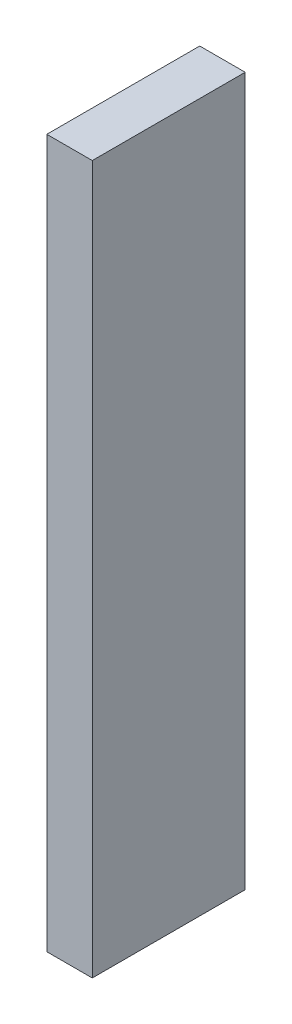
ISO-10303-21;
HEADER;
FILE_DESCRIPTION(('STEP AP214'),'2;1');
FILE_NAME('part.step','',(''),(''),'','','');
FILE_SCHEMA(('AUTOMOTIVE_DESIGN { 1 0 10303 214 1 1 1 1 }'));
ENDSEC;
DATA;
#1=APPLICATION_CONTEXT('core data for automotive mechanical design processes');
#2=APPLICATION_PROTOCOL_DEFINITION('international standard','automotive_design',2000,#1);
#3=PRODUCT_CONTEXT('',#1,'mechanical');
#4=PRODUCT('Part','Part','',(#3));
#5=PRODUCT_RELATED_PRODUCT_CATEGORY('part','',(#4));
#6=PRODUCT_DEFINITION_FORMATION('','',#4);
#7=PRODUCT_DEFINITION_CONTEXT('part definition',#1,'design');
#8=PRODUCT_DEFINITION('design','',#6,#7);
#9=PRODUCT_DEFINITION_SHAPE('','',#8);
#10=(LENGTH_UNIT() NAMED_UNIT(*) SI_UNIT(.MILLI.,.METRE.));
#11=(NAMED_UNIT(*) PLANE_ANGLE_UNIT() SI_UNIT($,.RADIAN.));
#12=(NAMED_UNIT(*) SI_UNIT($,.STERADIAN.) SOLID_ANGLE_UNIT());
#13=UNCERTAINTY_MEASURE_WITH_UNIT(LENGTH_MEASURE(1.E-05),#10,'distance_accuracy_value','');
#14=(GEOMETRIC_REPRESENTATION_CONTEXT(3) GLOBAL_UNCERTAINTY_ASSIGNED_CONTEXT((#13)) GLOBAL_UNIT_ASSIGNED_CONTEXT((#10,
#11,#12)) REPRESENTATION_CONTEXT('',''));
#15=CARTESIAN_POINT('',(0.,0.,0.));
#16=DIRECTION('',(0.,0.,1.));
#17=DIRECTION('',(1.,0.,0.));
#18=AXIS2_PLACEMENT_3D('',#15,#16,#17);
#19=CARTESIAN_POINT('',(130.275545220941,22.4180708263693,81.0720244776067));
#20=DIRECTION('',(-1.69244514382854E-09,0.,1.));
#21=DIRECTION('',(1.,0.,1.69244514382854E-09));
#22=AXIS2_PLACEMENT_3D('',#19,#20,#21);
#23=PLANE('',#22);
#24=DIRECTION('',(0.,-1.,0.));
#25=VECTOR('',#24,1.);
#26=CARTESIAN_POINT('',(131.258630317954,22.4180708263693,81.0720244792705));
#27=LINE('',#26,#25);
#28=CARTESIAN_POINT('',(131.258630317954,22.4180708263693,81.0720244792705));
#29=VERTEX_POINT('',#28);
#30=CARTESIAN_POINT('',(131.258630317954,7.11212965552236,81.0720244792705));
#31=VERTEX_POINT('',#30);
#32=EDGE_CURVE('E79',#29,#31,#27,.T.);
#33=ORIENTED_EDGE('',*,*,#32,.F.);
#34=DIRECTION('',(1.,0.,1.69244514382854E-09));
#35=VECTOR('',#34,1.);
#36=CARTESIAN_POINT('',(130.275545220941,22.4180708263693,81.0720244776067));
#37=LINE('',#36,#35);
#38=CARTESIAN_POINT('',(130.275545220941,22.4180708263693,81.0720244776067));
#39=VERTEX_POINT('',#38);
#40=EDGE_CURVE('E32',#39,#29,#37,.T.);
#41=ORIENTED_EDGE('',*,*,#40,.F.);
#42=DIRECTION('',(0.,-1.,0.));
#43=VECTOR('',#42,1.);
#44=CARTESIAN_POINT('',(130.275545220941,22.4180708263693,81.0720244776067));
#45=LINE('',#44,#43);
#46=CARTESIAN_POINT('',(130.275545220941,7.11212965552236,81.0720244776067));
#47=VERTEX_POINT('',#46);
#48=EDGE_CURVE('E71',#39,#47,#45,.T.);
#49=ORIENTED_EDGE('',*,*,#48,.T.);
#50=DIRECTION('',(1.,0.,1.69244514382854E-09));
#51=VECTOR('',#50,1.);
#52=CARTESIAN_POINT('',(130.275545220941,7.11212965552236,81.0720244776067));
#53=LINE('',#52,#51);
#54=EDGE_CURVE('E10',#47,#31,#53,.T.);
#55=ORIENTED_EDGE('',*,*,#54,.T.);
#56=EDGE_LOOP('',(#33,#41,#49,#55));
#57=FACE_BOUND('',#56,.T.);
#58=ADVANCED_FACE('F16',(#57),#23,.T.);
#59=CARTESIAN_POINT('',(130.275545220941,7.11212965552236,81.0720244776067));
#60=DIRECTION('',(0.,-1.,0.));
#61=DIRECTION('',(0.,0.,-1.));
#62=AXIS2_PLACEMENT_3D('',#59,#60,#61);
#63=PLANE('',#62);
#64=DIRECTION('',(1.69244514382854E-09,0.,-1.));
#65=VECTOR('',#64,1.);
#66=CARTESIAN_POINT('',(131.258630317954,7.11212965552236,81.0720244792705));
#67=LINE('',#66,#65);
#68=CARTESIAN_POINT('',(131.258630323549,7.11212965552235,77.7660833084218));
#69=VERTEX_POINT('',#68);
#70=EDGE_CURVE('E82',#31,#69,#67,.T.);
#71=ORIENTED_EDGE('',*,*,#70,.F.);
#72=ORIENTED_EDGE('',*,*,#54,.F.);
#73=DIRECTION('',(1.69244514382854E-09,0.,-1.));
#74=VECTOR('',#73,1.);
#75=CARTESIAN_POINT('',(130.275545220941,7.11212965552236,81.0720244776067));
#76=LINE('',#75,#74);
#77=CARTESIAN_POINT('',(130.275545226536,7.11212965552235,77.7660833067579));
#78=VERTEX_POINT('',#77);
#79=EDGE_CURVE('E67',#47,#78,#76,.T.);
#80=ORIENTED_EDGE('',*,*,#79,.T.);
#81=DIRECTION('',(1.,0.,1.69244514382854E-09));
#82=VECTOR('',#81,1.);
#83=CARTESIAN_POINT('',(130.275545226536,7.11212965552235,77.7660833067579));
#84=LINE('',#83,#82);
#85=EDGE_CURVE('E24',#78,#69,#84,.T.);
#86=ORIENTED_EDGE('',*,*,#85,.T.);
#87=EDGE_LOOP('',(#71,#72,#80,#86));
#88=FACE_BOUND('',#87,.T.);
#89=ADVANCED_FACE('F68',(#88),#63,.T.);
#90=CARTESIAN_POINT('',(130.275545226536,7.11212965552235,77.7660833067579));
#91=DIRECTION('',(1.69244514382854E-09,0.,-1.));
#92=DIRECTION('',(-1.,0.,-1.69244514382854E-09));
#93=AXIS2_PLACEMENT_3D('',#90,#91,#92);
#94=PLANE('',#93);
#95=DIRECTION('',(0.,1.,0.));
#96=VECTOR('',#95,1.);
#97=CARTESIAN_POINT('',(131.258630323549,7.11212965552235,77.7660833084218));
#98=LINE('',#97,#96);
#99=CARTESIAN_POINT('',(131.258630323549,22.418070826371,77.7660832999612));
#100=VERTEX_POINT('',#99);
#101=EDGE_CURVE('E65',#69,#100,#98,.T.);
#102=ORIENTED_EDGE('',*,*,#101,.F.);
#103=ORIENTED_EDGE('',*,*,#85,.F.);
#104=DIRECTION('',(0.,1.,0.));
#105=VECTOR('',#104,1.);
#106=CARTESIAN_POINT('',(130.275545226536,7.11212965552235,77.7660833067579));
#107=LINE('',#106,#105);
#108=CARTESIAN_POINT('',(130.275545226536,22.418070826371,77.7660832982974));
#109=VERTEX_POINT('',#108);
#110=EDGE_CURVE('E62',#78,#109,#107,.T.);
#111=ORIENTED_EDGE('',*,*,#110,.T.);
#112=DIRECTION('',(1.,0.,1.69244514382854E-09));
#113=VECTOR('',#112,1.);
#114=CARTESIAN_POINT('',(130.275545226536,22.418070826371,77.7660832982974));
#115=LINE('',#114,#113);
#116=EDGE_CURVE('E48',#109,#100,#115,.T.);
#117=ORIENTED_EDGE('',*,*,#116,.T.);
#118=EDGE_LOOP('',(#102,#103,#111,#117));
#119=FACE_BOUND('',#118,.T.);
#120=ADVANCED_FACE('F60',(#119),#94,.T.);
#121=CARTESIAN_POINT('',(130.275545226536,22.418070826371,77.7660832982974));
#122=DIRECTION('',(0.,1.,0.));
#123=DIRECTION('',(-1.,0.,0.));
#124=AXIS2_PLACEMENT_3D('',#121,#122,#123);
#125=PLANE('',#124);
#126=DIRECTION('',(-1.69244514382854E-09,0.,1.));
#127=VECTOR('',#126,1.);
#128=CARTESIAN_POINT('',(131.258630323549,22.418070826371,77.7660832999612));
#129=LINE('',#128,#127);
#130=EDGE_CURVE('E85',#100,#29,#129,.T.);
#131=ORIENTED_EDGE('',*,*,#130,.F.);
#132=ORIENTED_EDGE('',*,*,#116,.F.);
#133=DIRECTION('',(-1.69244514382854E-09,0.,1.));
#134=VECTOR('',#133,1.);
#135=CARTESIAN_POINT('',(130.275545226536,22.418070826371,77.7660832982974));
#136=LINE('',#135,#134);
#137=EDGE_CURVE('E74',#109,#39,#136,.T.);
#138=ORIENTED_EDGE('',*,*,#137,.T.);
#139=ORIENTED_EDGE('',*,*,#40,.T.);
#140=EDGE_LOOP('',(#131,#132,#138,#139));
#141=FACE_BOUND('',#140,.T.);
#142=ADVANCED_FACE('F96',(#141),#125,.T.);
#143=CARTESIAN_POINT('',(130.275545201028,17.2651002409467,92.8378607087388));
#144=DIRECTION('',(1.,0.,1.69244514382854E-09));
#145=DIRECTION('',(0.,1.,0.));
#146=AXIS2_PLACEMENT_3D('',#143,#144,#145);
#147=PLANE('',#146);
#148=ORIENTED_EDGE('',*,*,#48,.F.);
#149=ORIENTED_EDGE('',*,*,#137,.F.);
#150=ORIENTED_EDGE('',*,*,#110,.F.);
#151=ORIENTED_EDGE('',*,*,#79,.F.);
#152=EDGE_LOOP('',(#148,#149,#150,#151));
#153=FACE_BOUND('',#152,.T.);
#154=ADVANCED_FACE('F73',(#153),#147,.F.);
#155=CARTESIAN_POINT('',(131.258630298041,17.2651002409467,92.8378607104026));
#156=DIRECTION('',(1.,0.,1.69244514382854E-09));
#157=DIRECTION('',(0.,1.,0.));
#158=AXIS2_PLACEMENT_3D('',#155,#156,#157);
#159=PLANE('',#158);
#160=ORIENTED_EDGE('',*,*,#32,.T.);
#161=ORIENTED_EDGE('',*,*,#70,.T.);
#162=ORIENTED_EDGE('',*,*,#101,.T.);
#163=ORIENTED_EDGE('',*,*,#130,.T.);
#164=EDGE_LOOP('',(#160,#161,#162,#163));
#165=FACE_BOUND('',#164,.T.);
#166=ADVANCED_FACE('F89',(#165),#159,.T.);
#167=CLOSED_SHELL('',(#58,#89,#120,#142,#154,#166));
#168=MANIFOLD_SOLID_BREP('B1',#167);
#169=ADVANCED_BREP_SHAPE_REPRESENTATION('',(#18,#168),#14);
#170=SHAPE_DEFINITION_REPRESENTATION(#9,#169);
ENDSEC;
END-ISO-10303-21;
